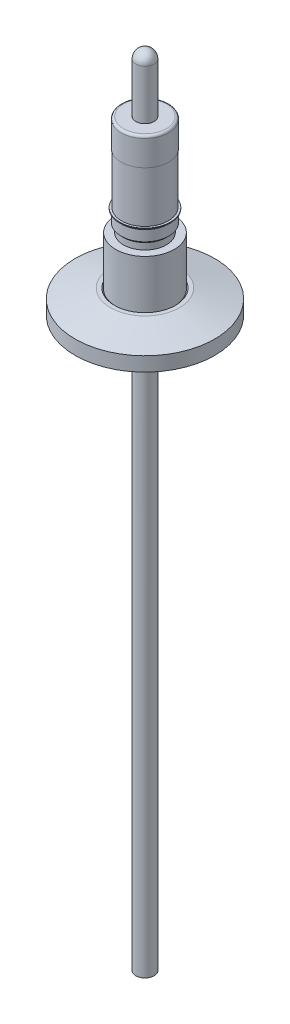
ISO-10303-21;
HEADER;
FILE_DESCRIPTION(('STEP AP214'),'2;1');
FILE_NAME('part.step','',(''),(''),'','','');
FILE_SCHEMA(('AUTOMOTIVE_DESIGN { 1 0 10303 214 1 1 1 1 }'));
ENDSEC;
DATA;
#1=APPLICATION_CONTEXT('core data for automotive mechanical design processes');
#2=APPLICATION_PROTOCOL_DEFINITION('international standard','automotive_design',2000,#1);
#3=PRODUCT_CONTEXT('',#1,'mechanical');
#4=PRODUCT('Part','Part','',(#3));
#5=PRODUCT_RELATED_PRODUCT_CATEGORY('part','',(#4));
#6=PRODUCT_DEFINITION_FORMATION('','',#4);
#7=PRODUCT_DEFINITION_CONTEXT('part definition',#1,'design');
#8=PRODUCT_DEFINITION('design','',#6,#7);
#9=PRODUCT_DEFINITION_SHAPE('','',#8);
#10=(LENGTH_UNIT() NAMED_UNIT(*) SI_UNIT(.MILLI.,.METRE.));
#11=(NAMED_UNIT(*) PLANE_ANGLE_UNIT() SI_UNIT($,.RADIAN.));
#12=(NAMED_UNIT(*) SI_UNIT($,.STERADIAN.) SOLID_ANGLE_UNIT());
#13=UNCERTAINTY_MEASURE_WITH_UNIT(LENGTH_MEASURE(1.E-05),#10,'distance_accuracy_value','');
#14=(GEOMETRIC_REPRESENTATION_CONTEXT(3) GLOBAL_UNCERTAINTY_ASSIGNED_CONTEXT((#13)) GLOBAL_UNIT_ASSIGNED_CONTEXT((#10,
#11,#12)) REPRESENTATION_CONTEXT('',''));
#15=CARTESIAN_POINT('',(0.,0.,0.));
#16=DIRECTION('',(0.,0.,1.));
#17=DIRECTION('',(1.,0.,0.));
#18=AXIS2_PLACEMENT_3D('',#15,#16,#17);
#19=CARTESIAN_POINT('',(5.5245,0.,0.));
#20=DIRECTION('',(0.,-1.,0.));
#21=DIRECTION('',(0.,0.,-1.));
#22=AXIS2_PLACEMENT_3D('',#19,#20,#21);
#23=PLANE('',#22);
#24=CARTESIAN_POINT('',(0.,0.,0.));
#25=DIRECTION('',(0.,1.,0.));
#26=DIRECTION('',(1.,0.,0.));
#27=AXIS2_PLACEMENT_3D('',#24,#25,#26);
#28=CIRCLE('',#27,8.6995);
#29=CARTESIAN_POINT('',(8.6995,0.,0.));
#30=VERTEX_POINT('',#29);
#31=EDGE_CURVE('E191',#30,#30,#28,.T.);
#32=ORIENTED_EDGE('',*,*,#31,.F.);
#33=EDGE_LOOP('',(#32));
#34=FACE_BOUND('',#33,.T.);
#35=CARTESIAN_POINT('',(0.,0.,0.));
#36=DIRECTION('',(0.,-1.,0.));
#37=DIRECTION('',(0.,0.,-1.));
#38=AXIS2_PLACEMENT_3D('',#35,#36,#37);
#39=CIRCLE('',#38,5.5245);
#40=CARTESIAN_POINT('',(0.,0.,-5.5245));
#41=VERTEX_POINT('',#40);
#42=EDGE_CURVE('E11',#41,#41,#39,.T.);
#43=ORIENTED_EDGE('',*,*,#42,.F.);
#44=EDGE_LOOP('',(#43));
#45=FACE_BOUND('',#44,.T.);
#46=ADVANCED_FACE('F19',(#34,#45),#23,.T.);
#47=CARTESIAN_POINT('',(0.,0.,0.));
#48=DIRECTION('',(0.,-1.,0.));
#49=DIRECTION('',(0.,0.,-1.));
#50=AXIS2_PLACEMENT_3D('',#47,#48,#49);
#51=CYLINDRICAL_SURFACE('',#50,5.5245);
#52=CARTESIAN_POINT('',(0.,6.35,0.));
#53=DIRECTION('',(0.,-1.,0.));
#54=DIRECTION('',(0.,0.,-1.));
#55=AXIS2_PLACEMENT_3D('',#52,#53,#54);
#56=CIRCLE('',#55,5.5245);
#57=CARTESIAN_POINT('',(0.,6.35,-5.5245));
#58=VERTEX_POINT('',#57);
#59=EDGE_CURVE('E30',#58,#58,#56,.T.);
#60=ORIENTED_EDGE('',*,*,#59,.F.);
#61=EDGE_LOOP('',(#60));
#62=FACE_BOUND('',#61,.T.);
#63=ORIENTED_EDGE('',*,*,#42,.T.);
#64=EDGE_LOOP('',(#63));
#65=FACE_BOUND('',#64,.T.);
#66=ADVANCED_FACE('F280',(#62,#65),#51,.F.);
#67=CARTESIAN_POINT('',(4.2672,6.35,0.));
#68=DIRECTION('',(0.,-1.,0.));
#69=DIRECTION('',(0.,0.,-1.));
#70=AXIS2_PLACEMENT_3D('',#67,#68,#69);
#71=PLANE('',#70);
#72=CARTESIAN_POINT('',(0.,6.35,0.));
#73=DIRECTION('',(0.,-1.,0.));
#74=DIRECTION('',(0.,0.,-1.));
#75=AXIS2_PLACEMENT_3D('',#72,#73,#74);
#76=CIRCLE('',#75,4.064);
#77=CARTESIAN_POINT('',(0.,6.35,-4.064));
#78=VERTEX_POINT('',#77);
#79=EDGE_CURVE('E192',#78,#78,#76,.T.);
#80=ORIENTED_EDGE('',*,*,#79,.F.);
#81=EDGE_LOOP('',(#80));
#82=FACE_BOUND('',#81,.T.);
#83=ORIENTED_EDGE('',*,*,#59,.T.);
#84=EDGE_LOOP('',(#83));
#85=FACE_BOUND('',#84,.T.);
#86=ADVANCED_FACE('F285',(#82,#85),#71,.T.);
#87=CARTESIAN_POINT('',(0.,3.05201287254541,0.));
#88=DIRECTION('',(0.,-1.,0.));
#89=DIRECTION('',(0.0635421050136828,0.,-0.997979158545122));
#90=AXIS2_PLACEMENT_3D('',#87,#88,#89);
#91=CYLINDRICAL_SURFACE('',#90,4.064);
#92=ORIENTED_EDGE('',*,*,#79,.T.);
#93=EDGE_LOOP('',(#92));
#94=FACE_BOUND('',#93,.T.);
#95=CARTESIAN_POINT('',(0.,5.4947420489686,0.));
#96=DIRECTION('',(0.,-1.,0.));
#97=DIRECTION('',(0.0635421050136828,0.,-0.997979158545122));
#98=AXIS2_PLACEMENT_3D('',#95,#96,#97);
#99=CIRCLE('',#98,4.064);
#100=CARTESIAN_POINT('',(0.258235114775605,5.4947420489686,-4.05578730032739));
#101=VERTEX_POINT('',#100);
#102=EDGE_CURVE('E196',#101,#101,#99,.T.);
#103=ORIENTED_EDGE('',*,*,#102,.F.);
#104=EDGE_LOOP('',(#103));
#105=FACE_BOUND('',#104,.T.);
#106=ADVANCED_FACE('F294',(#94,#105),#91,.T.);
#107=CARTESIAN_POINT('',(0.,5.24074204896862,0.));
#108=DIRECTION('',(0.,1.,0.));
#109=DIRECTION('',(-0.0635421050136827,0.,0.997979158545122));
#110=AXIS2_PLACEMENT_3D('',#107,#108,#109);
#111=CONICAL_SURFACE('',#110,3.81,0.785398163397442);
#112=CARTESIAN_POINT('',(0.,5.24074204896862,0.));
#113=DIRECTION('',(0.,-1.,0.));
#114=DIRECTION('',(0.0635421050136827,0.,-0.997979158545122));
#115=AXIS2_PLACEMENT_3D('',#112,#113,#114);
#116=CIRCLE('',#115,3.81);
#117=CARTESIAN_POINT('',(0.242095420102132,5.24074204896862,-3.80230059405693));
#118=VERTEX_POINT('',#117);
#119=EDGE_CURVE('E217',#118,#118,#116,.T.);
#120=ORIENTED_EDGE('',*,*,#119,.F.);
#121=EDGE_LOOP('',(#120));
#122=FACE_BOUND('',#121,.T.);
#123=ORIENTED_EDGE('',*,*,#102,.T.);
#124=EDGE_LOOP('',(#123));
#125=FACE_BOUND('',#124,.T.);
#126=ADVANCED_FACE('F290',(#122,#125),#111,.T.);
#127=CARTESIAN_POINT('',(1.92649896765551,5.24074204896862,0.122661679518413));
#128=DIRECTION('',(0.,-1.,0.));
#129=DIRECTION('',(0.,0.,-1.));
#130=AXIS2_PLACEMENT_3D('',#127,#128,#129);
#131=PLANE('',#130);
#132=ORIENTED_EDGE('',*,*,#119,.T.);
#133=EDGE_LOOP('',(#132));
#134=FACE_BOUND('',#133,.T.);
#135=CARTESIAN_POINT('',(0.,5.24074204896862,0.));
#136=DIRECTION('',(0.,1.,0.));
#137=DIRECTION('',(0.,0.,-1.));
#138=AXIS2_PLACEMENT_3D('',#135,#136,#137);
#139=CIRCLE('',#138,1.9558);
#140=CARTESIAN_POINT('',(0.,5.24074204896862,-1.9558));
#141=VERTEX_POINT('',#140);
#142=EDGE_CURVE('E210',#141,#141,#139,.T.);
#143=ORIENTED_EDGE('',*,*,#142,.T.);
#144=EDGE_LOOP('',(#143));
#145=FACE_BOUND('',#144,.T.);
#146=ADVANCED_FACE('F293',(#134,#145),#131,.T.);
#147=CARTESIAN_POINT('',(0.,46.9373820489687,0.));
#148=DIRECTION('',(0.,-1.,0.));
#149=DIRECTION('',(0.,0.,-1.));
#150=AXIS2_PLACEMENT_3D('',#147,#148,#149);
#151=CYLINDRICAL_SURFACE('',#150,1.9558);
#152=ORIENTED_EDGE('',*,*,#142,.F.);
#153=EDGE_LOOP('',(#152));
#154=FACE_BOUND('',#153,.T.);
#155=CARTESIAN_POINT('',(0.,-124.512617951032,0.));
#156=DIRECTION('',(0.,1.,0.));
#157=DIRECTION('',(0.,0.,1.));
#158=AXIS2_PLACEMENT_3D('',#155,#156,#157);
#159=CIRCLE('',#158,1.9558);
#160=CARTESIAN_POINT('',(0.,-124.512617951032,1.9558));
#161=VERTEX_POINT('',#160);
#162=EDGE_CURVE('E23',#161,#161,#159,.T.);
#163=ORIENTED_EDGE('',*,*,#162,.T.);
#164=EDGE_LOOP('',(#163));
#165=FACE_BOUND('',#164,.T.);
#166=ADVANCED_FACE('F322',(#154,#165),#151,.T.);
#167=CARTESIAN_POINT('',(0.,-124.512617951032,0.));
#168=DIRECTION('',(0.,1.,0.));
#169=DIRECTION('',(1.,0.,0.));
#170=AXIS2_PLACEMENT_3D('',#167,#168,#169);
#171=PLANE('',#170);
#172=ORIENTED_EDGE('',*,*,#162,.F.);
#173=EDGE_LOOP('',(#172));
#174=FACE_BOUND('',#173,.T.);
#175=ADVANCED_FACE('F324',(#174),#171,.F.);
#176=CARTESIAN_POINT('',(0.,0.,0.));
#177=DIRECTION('',(0.,-1.,0.));
#178=DIRECTION('',(1.,0.,0.));
#179=AXIS2_PLACEMENT_3D('',#176,#177,#178);
#180=CYLINDRICAL_SURFACE('',#179,8.6995);
#181=CARTESIAN_POINT('',(0.,-2.667,0.));
#182=DIRECTION('',(0.,1.,0.));
#183=DIRECTION('',(1.,0.,0.));
#184=AXIS2_PLACEMENT_3D('',#181,#182,#183);
#185=CIRCLE('',#184,8.6995);
#186=CARTESIAN_POINT('',(8.6995,-2.667,0.));
#187=VERTEX_POINT('',#186);
#188=EDGE_CURVE('E203',#187,#187,#185,.T.);
#189=ORIENTED_EDGE('',*,*,#188,.F.);
#190=EDGE_LOOP('',(#189));
#191=FACE_BOUND('',#190,.T.);
#192=ORIENTED_EDGE('',*,*,#31,.T.);
#193=EDGE_LOOP('',(#192));
#194=FACE_BOUND('',#193,.T.);
#195=ADVANCED_FACE('F330',(#191,#194),#180,.F.);
#196=CARTESIAN_POINT('',(0.,2.159,0.));
#197=DIRECTION('',(0.,1.,0.));
#198=DIRECTION('',(-1.,0.,0.));
#199=AXIS2_PLACEMENT_3D('',#196,#197,#198);
#200=CONICAL_SURFACE('',#199,6.2865,0.78539816339745);
#201=CARTESIAN_POINT('',(0.,2.413,0.));
#202=DIRECTION('',(0.,-1.,0.));
#203=DIRECTION('',(-1.,0.,0.));
#204=AXIS2_PLACEMENT_3D('',#201,#202,#203);
#205=CIRCLE('',#204,6.5405);
#206=CARTESIAN_POINT('',(-6.5405,2.413,0.));
#207=VERTEX_POINT('',#206);
#208=EDGE_CURVE('E127',#207,#207,#205,.T.);
#209=ORIENTED_EDGE('',*,*,#208,.F.);
#210=EDGE_LOOP('',(#209));
#211=FACE_BOUND('',#210,.T.);
#212=CARTESIAN_POINT('',(0.,2.159,0.));
#213=DIRECTION('',(0.,-1.,0.));
#214=DIRECTION('',(0.,0.,1.));
#215=AXIS2_PLACEMENT_3D('',#212,#213,#214);
#216=CIRCLE('',#215,6.2865);
#217=CARTESIAN_POINT('',(0.,2.159,6.2865));
#218=VERTEX_POINT('',#217);
#219=EDGE_CURVE('E170',#218,#218,#216,.T.);
#220=ORIENTED_EDGE('',*,*,#219,.T.);
#221=EDGE_LOOP('',(#220));
#222=FACE_BOUND('',#221,.T.);
#223=ADVANCED_FACE('F299',(#211,#222),#200,.F.);
#224=CARTESIAN_POINT('',(0.,3.78395474387525,0.));
#225=DIRECTION('',(0.,-1.,0.));
#226=DIRECTION('',(1.,0.,0.));
#227=AXIS2_PLACEMENT_3D('',#224,#225,#226);
#228=CONICAL_SURFACE('',#227,2.286,1.30899693899575);
#229=CARTESIAN_POINT('',(0.,2.413,0.));
#230=DIRECTION('',(0.,1.,0.));
#231=DIRECTION('',(-1.,0.,0.));
#232=AXIS2_PLACEMENT_3D('',#229,#230,#231);
#233=CIRCLE('',#232,7.40247275902005);
#234=CARTESIAN_POINT('',(-7.40247275902005,2.413,0.));
#235=VERTEX_POINT('',#234);
#236=EDGE_CURVE('E117',#235,#235,#233,.T.);
#237=ORIENTED_EDGE('',*,*,#236,.F.);
#238=EDGE_LOOP('',(#237));
#239=FACE_BOUND('',#238,.T.);
#240=CARTESIAN_POINT('',(0.,0.381,0.));
#241=DIRECTION('',(0.,1.,0.));
#242=DIRECTION('',(-1.,0.,0.));
#243=AXIS2_PLACEMENT_3D('',#240,#241,#242);
#244=CIRCLE('',#243,14.986);
#245=CARTESIAN_POINT('',(-14.986,0.381,0.));
#246=VERTEX_POINT('',#245);
#247=EDGE_CURVE('E188',#246,#246,#244,.T.);
#248=ORIENTED_EDGE('',*,*,#247,.T.);
#249=EDGE_LOOP('',(#248));
#250=FACE_BOUND('',#249,.T.);
#251=ADVANCED_FACE('F296',(#239,#250),#228,.T.);
#252=CARTESIAN_POINT('',(0.,-2.667,0.));
#253=DIRECTION('',(0.,1.,0.));
#254=DIRECTION('',(-1.,0.,0.));
#255=AXIS2_PLACEMENT_3D('',#252,#253,#254);
#256=CYLINDRICAL_SURFACE('',#255,14.986);
#257=ORIENTED_EDGE('',*,*,#247,.F.);
#258=EDGE_LOOP('',(#257));
#259=FACE_BOUND('',#258,.T.);
#260=CARTESIAN_POINT('',(0.,-2.667,0.));
#261=DIRECTION('',(0.,1.,0.));
#262=DIRECTION('',(1.,0.,0.));
#263=AXIS2_PLACEMENT_3D('',#260,#261,#262);
#264=CIRCLE('',#263,14.986);
#265=CARTESIAN_POINT('',(14.986,-2.667,0.));
#266=VERTEX_POINT('',#265);
#267=EDGE_CURVE('E183',#266,#266,#264,.T.);
#268=ORIENTED_EDGE('',*,*,#267,.T.);
#269=EDGE_LOOP('',(#268));
#270=FACE_BOUND('',#269,.T.);
#271=ADVANCED_FACE('F298',(#259,#270),#256,.T.);
#272=CARTESIAN_POINT('',(0.,2.413,0.));
#273=DIRECTION('',(0.,1.,0.));
#274=DIRECTION('',(0.,0.,-1.));
#275=AXIS2_PLACEMENT_3D('',#272,#273,#274);
#276=PLANE('',#275);
#277=ORIENTED_EDGE('',*,*,#236,.T.);
#278=EDGE_LOOP('',(#277));
#279=FACE_BOUND('',#278,.T.);
#280=ORIENTED_EDGE('',*,*,#208,.T.);
#281=EDGE_LOOP('',(#280));
#282=FACE_BOUND('',#281,.T.);
#283=ADVANCED_FACE('F274',(#279,#282),#276,.T.);
#284=CARTESIAN_POINT('',(0.,-2.667,0.));
#285=DIRECTION('',(0.,1.,0.));
#286=DIRECTION('',(0.,0.,-1.));
#287=AXIS2_PLACEMENT_3D('',#284,#285,#286);
#288=PLANE('',#287);
#289=ORIENTED_EDGE('',*,*,#188,.T.);
#290=EDGE_LOOP('',(#289));
#291=FACE_BOUND('',#290,.T.);
#292=ORIENTED_EDGE('',*,*,#267,.F.);
#293=EDGE_LOOP('',(#292));
#294=FACE_BOUND('',#293,.T.);
#295=ADVANCED_FACE('F264',(#291,#294),#288,.F.);
#296=CARTESIAN_POINT('',(0.,46.9373820489687,0.));
#297=DIRECTION('',(0.,-1.,0.));
#298=DIRECTION('',(0.,0.,-1.));
#299=AXIS2_PLACEMENT_3D('',#296,#297,#298);
#300=CYLINDRICAL_SURFACE('',#299,1.9558);
#301=CARTESIAN_POINT('',(0.,44.9841220489684,0.));
#302=DIRECTION('',(0.,-1.,0.));
#303=DIRECTION('',(0.,0.,1.));
#304=AXIS2_PLACEMENT_3D('',#301,#302,#303);
#305=CIRCLE('',#304,1.9558);
#306=CARTESIAN_POINT('',(0.,44.9841220489684,1.9558));
#307=VERTEX_POINT('',#306);
#308=EDGE_CURVE('E247',#307,#307,#305,.T.);
#309=ORIENTED_EDGE('',*,*,#308,.T.);
#310=EDGE_LOOP('',(#309));
#311=FACE_BOUND('',#310,.T.);
#312=CARTESIAN_POINT('',(0.,34.306684097937,0.));
#313=DIRECTION('',(0.,-1.,0.));
#314=DIRECTION('',(0.,0.,1.));
#315=AXIS2_PLACEMENT_3D('',#312,#313,#314);
#316=CIRCLE('',#315,1.9558);
#317=CARTESIAN_POINT('',(0.,34.306684097937,1.9558));
#318=VERTEX_POINT('',#317);
#319=EDGE_CURVE('E186',#318,#318,#316,.T.);
#320=ORIENTED_EDGE('',*,*,#319,.F.);
#321=EDGE_LOOP('',(#320));
#322=FACE_BOUND('',#321,.T.);
#323=ADVANCED_FACE('F261',(#311,#322),#300,.T.);
#324=CARTESIAN_POINT('',(0.,44.9841220489684,0.));
#325=DIRECTION('',(0.,1.,0.));
#326=DIRECTION('',(0.,0.,1.));
#327=AXIS2_PLACEMENT_3D('',#324,#325,#326);
#328=DEGENERATE_TOROIDAL_SURFACE('',#327,0.00253999999999923,1.95326,.T.);
#329=ORIENTED_EDGE('',*,*,#308,.F.);
#330=EDGE_LOOP('',(#329));
#331=FACE_BOUND('',#330,.T.);
#332=CARTESIAN_POINT('',(0.,46.9373820489687,0.));
#333=DIRECTION('',(0.,1.,0.));
#334=DIRECTION('',(0.,0.,1.));
#335=AXIS2_PLACEMENT_3D('',#332,#333,#334);
#336=CIRCLE('',#335,0.00253999999999923);
#337=CARTESIAN_POINT('',(0.,46.9373820489687,0.00253999999999923));
#338=VERTEX_POINT('',#337);
#339=EDGE_CURVE('E199',#338,#338,#336,.T.);
#340=ORIENTED_EDGE('',*,*,#339,.F.);
#341=EDGE_LOOP('',(#340));
#342=FACE_BOUND('',#341,.T.);
#343=ADVANCED_FACE('F263',(#331,#342),#328,.T.);
#344=CARTESIAN_POINT('',(0.,3.05201287254541,0.));
#345=DIRECTION('',(0.,-1.,0.));
#346=DIRECTION('',(0.0635421050136827,0.,-0.997979158545122));
#347=AXIS2_PLACEMENT_3D('',#344,#345,#346);
#348=CYLINDRICAL_SURFACE('',#347,5.1054);
#349=CARTESIAN_POINT('',(0.,33.798684097937,0.));
#350=DIRECTION('',(0.,-1.,0.));
#351=DIRECTION('',(0.0635421050136827,0.,-0.997979158545122));
#352=AXIS2_PLACEMENT_3D('',#349,#350,#351);
#353=CIRCLE('',#352,5.1054);
#354=CARTESIAN_POINT('',(0.324407862936855,33.798684097937,-5.09508279603628));
#355=VERTEX_POINT('',#354);
#356=EDGE_CURVE('E164',#355,#355,#353,.T.);
#357=ORIENTED_EDGE('',*,*,#356,.T.);
#358=EDGE_LOOP('',(#357));
#359=FACE_BOUND('',#358,.T.);
#360=CARTESIAN_POINT('',(0.,28.337684097937,0.));
#361=DIRECTION('',(0.,-1.,0.));
#362=DIRECTION('',(0.0635421050136827,0.,-0.997979158545122));
#363=AXIS2_PLACEMENT_3D('',#360,#361,#362);
#364=CIRCLE('',#363,5.1054);
#365=CARTESIAN_POINT('',(0.324407862936855,28.337684097937,-5.09508279603628));
#366=VERTEX_POINT('',#365);
#367=EDGE_CURVE('E237',#366,#366,#364,.T.);
#368=ORIENTED_EDGE('',*,*,#367,.F.);
#369=EDGE_LOOP('',(#368));
#370=FACE_BOUND('',#369,.T.);
#371=ADVANCED_FACE('F165',(#359,#370),#348,.T.);
#372=CARTESIAN_POINT('',(0.,3.05201287254541,0.));
#373=DIRECTION('',(0.,-1.,0.));
#374=DIRECTION('',(0.0635421050136827,0.,-0.997979158545122));
#375=AXIS2_PLACEMENT_3D('',#372,#373,#374);
#376=CYLINDRICAL_SURFACE('',#375,5.0165);
#377=CARTESIAN_POINT('',(0.,28.337684097937,0.));
#378=DIRECTION('',(0.,-1.,0.));
#379=DIRECTION('',(0.0635421050136827,0.,-0.997979158545122));
#380=AXIS2_PLACEMENT_3D('',#377,#378,#379);
#381=CIRCLE('',#380,5.0165);
#382=CARTESIAN_POINT('',(0.318758969801139,28.337684097937,-5.00636244884161));
#383=VERTEX_POINT('',#382);
#384=EDGE_CURVE('E202',#383,#383,#381,.T.);
#385=ORIENTED_EDGE('',*,*,#384,.T.);
#386=EDGE_LOOP('',(#385));
#387=FACE_BOUND('',#386,.T.);
#388=CARTESIAN_POINT('',(0.,17.3676174387893,0.));
#389=DIRECTION('',(0.,-1.,0.));
#390=DIRECTION('',(0.0635421050136827,0.,-0.997979158545122));
#391=AXIS2_PLACEMENT_3D('',#388,#389,#390);
#392=CIRCLE('',#391,5.0165);
#393=CARTESIAN_POINT('',(0.318758969801139,17.3676174387893,-5.00636244884161));
#394=VERTEX_POINT('',#393);
#395=EDGE_CURVE('E100',#394,#394,#392,.T.);
#396=ORIENTED_EDGE('',*,*,#395,.F.);
#397=EDGE_LOOP('',(#396));
#398=FACE_BOUND('',#397,.T.);
#399=ADVANCED_FACE('F362',(#387,#398),#376,.T.);
#400=CARTESIAN_POINT('',(0.,3.05201287254541,0.));
#401=DIRECTION('',(0.,-1.,0.));
#402=DIRECTION('',(0.0635421050136827,0.,-0.997979158545122));
#403=AXIS2_PLACEMENT_3D('',#400,#401,#402);
#404=CYLINDRICAL_SURFACE('',#403,5.4492025612107);
#405=CARTESIAN_POINT('',(0.,17.3676174387893,0.));
#406=DIRECTION('',(0.,-1.,0.));
#407=DIRECTION('',(0.0635421050136827,0.,-0.997979158545122));
#408=AXIS2_PLACEMENT_3D('',#405,#406,#407);
#409=CIRCLE('',#408,5.4492025612107);
#410=CARTESIAN_POINT('',(0.346253801385279,17.3676174387893,-5.43819058677896));
#411=VERTEX_POINT('',#410);
#412=EDGE_CURVE('E109',#411,#411,#409,.T.);
#413=ORIENTED_EDGE('',*,*,#412,.T.);
#414=EDGE_LOOP('',(#413));
#415=FACE_BOUND('',#414,.T.);
#416=CARTESIAN_POINT('',(0.,17.188012316368,0.));
#417=DIRECTION('',(0.,-1.,0.));
#418=DIRECTION('',(0.0635421050136827,0.,-0.997979158545122));
#419=AXIS2_PLACEMENT_3D('',#416,#417,#418);
#420=CIRCLE('',#419,5.4492025612107);
#421=CARTESIAN_POINT('',(0.346253801385279,17.188012316368,-5.43819058677896));
#422=VERTEX_POINT('',#421);
#423=EDGE_CURVE('E243',#422,#422,#420,.T.);
#424=ORIENTED_EDGE('',*,*,#423,.F.);
#425=EDGE_LOOP('',(#424));
#426=FACE_BOUND('',#425,.T.);
#427=ADVANCED_FACE('F21',(#415,#426),#404,.T.);
#428=CARTESIAN_POINT('',(0.,16.8442097551572,0.));
#429=DIRECTION('',(0.,1.,0.));
#430=DIRECTION('',(-0.0635421050136827,0.,0.997979158545122));
#431=AXIS2_PLACEMENT_3D('',#428,#429,#430);
#432=CONICAL_SURFACE('',#431,5.1054,0.78539816339745);
#433=CARTESIAN_POINT('',(0.,16.8442097551572,0.));
#434=DIRECTION('',(0.,-1.,0.));
#435=DIRECTION('',(0.0635421050136827,0.,-0.997979158545122));
#436=AXIS2_PLACEMENT_3D('',#433,#434,#435);
#437=CIRCLE('',#436,5.1054);
#438=CARTESIAN_POINT('',(0.324407862936855,16.8442097551572,-5.09508279603628));
#439=VERTEX_POINT('',#438);
#440=EDGE_CURVE('E248',#439,#439,#437,.T.);
#441=ORIENTED_EDGE('',*,*,#440,.F.);
#442=EDGE_LOOP('',(#441));
#443=FACE_BOUND('',#442,.T.);
#444=ORIENTED_EDGE('',*,*,#423,.T.);
#445=EDGE_LOOP('',(#444));
#446=FACE_BOUND('',#445,.T.);
#447=ADVANCED_FACE('F302',(#443,#446),#432,.T.);
#448=CARTESIAN_POINT('',(0.,3.05201287254541,0.));
#449=DIRECTION('',(0.,-1.,0.));
#450=DIRECTION('',(0.0635421050136827,0.,-0.997979158545122));
#451=AXIS2_PLACEMENT_3D('',#448,#449,#450);
#452=CYLINDRICAL_SURFACE('',#451,5.1054);
#453=ORIENTED_EDGE('',*,*,#440,.T.);
#454=EDGE_LOOP('',(#453));
#455=FACE_BOUND('',#454,.T.);
#456=CARTESIAN_POINT('',(0.,14.5741846327359,0.));
#457=DIRECTION('',(0.,-1.,0.));
#458=DIRECTION('',(0.0635421050136827,0.,-0.997979158545122));
#459=AXIS2_PLACEMENT_3D('',#456,#457,#458);
#460=CIRCLE('',#459,5.1054);
#461=CARTESIAN_POINT('',(0.324407862936855,14.5741846327359,-5.09508279603628));
#462=VERTEX_POINT('',#461);
#463=EDGE_CURVE('E176',#462,#462,#460,.T.);
#464=ORIENTED_EDGE('',*,*,#463,.F.);
#465=EDGE_LOOP('',(#464));
#466=FACE_BOUND('',#465,.T.);
#467=ADVANCED_FACE('F304',(#455,#466),#452,.T.);
#468=CARTESIAN_POINT('',(0.,14.0788846327359,0.));
#469=DIRECTION('',(0.,1.,0.));
#470=DIRECTION('',(-0.0635421050136827,0.,0.997979158545122));
#471=AXIS2_PLACEMENT_3D('',#468,#469,#470);
#472=CONICAL_SURFACE('',#471,4.6101,0.785398163397451);
#473=CARTESIAN_POINT('',(0.,14.0788846327359,0.));
#474=DIRECTION('',(0.,-1.,0.));
#475=DIRECTION('',(0.0635421050136827,0.,-0.997979158545122));
#476=AXIS2_PLACEMENT_3D('',#473,#474,#475);
#477=CIRCLE('',#476,4.6101);
#478=CARTESIAN_POINT('',(0.292935458323578,14.0788846327359,-4.60078371880888));
#479=VERTEX_POINT('',#478);
#480=EDGE_CURVE('E169',#479,#479,#477,.T.);
#481=ORIENTED_EDGE('',*,*,#480,.F.);
#482=EDGE_LOOP('',(#481));
#483=FACE_BOUND('',#482,.T.);
#484=ORIENTED_EDGE('',*,*,#463,.T.);
#485=EDGE_LOOP('',(#484));
#486=FACE_BOUND('',#485,.T.);
#487=ADVANCED_FACE('F309',(#483,#486),#472,.T.);
#488=CARTESIAN_POINT('',(0.,3.05201287254541,0.));
#489=DIRECTION('',(0.,-1.,0.));
#490=DIRECTION('',(0.0635421050136827,0.,-0.997979158545122));
#491=AXIS2_PLACEMENT_3D('',#488,#489,#490);
#492=CYLINDRICAL_SURFACE('',#491,4.6101);
#493=ORIENTED_EDGE('',*,*,#480,.T.);
#494=EDGE_LOOP('',(#493));
#495=FACE_BOUND('',#494,.T.);
#496=CARTESIAN_POINT('',(0.,12.7,0.));
#497=DIRECTION('',(0.,1.,0.));
#498=DIRECTION('',(0.,0.,1.));
#499=AXIS2_PLACEMENT_3D('',#496,#497,#498);
#500=CIRCLE('',#499,4.6101);
#501=CARTESIAN_POINT('',(0.,12.7,4.6101));
#502=VERTEX_POINT('',#501);
#503=EDGE_CURVE('E184',#502,#502,#500,.T.);
#504=ORIENTED_EDGE('',*,*,#503,.T.);
#505=EDGE_LOOP('',(#504));
#506=FACE_BOUND('',#505,.T.);
#507=ADVANCED_FACE('F312',(#495,#506),#492,.T.);
#508=CARTESIAN_POINT('',(0.,33.798684097937,0.));
#509=DIRECTION('',(0.,-1.,0.));
#510=DIRECTION('',(0.0635421050136827,0.,-0.997979158545122));
#511=AXIS2_PLACEMENT_3D('',#508,#509,#510);
#512=TOROIDAL_SURFACE('',#511,4.5974,0.508);
#513=CARTESIAN_POINT('',(0.,34.306684097937,0.));
#514=DIRECTION('',(0.,-1.,0.));
#515=DIRECTION('',(0.0635421050136827,0.,-0.997979158545122));
#516=AXIS2_PLACEMENT_3D('',#513,#514,#515);
#517=CIRCLE('',#516,4.5974);
#518=CARTESIAN_POINT('',(0.292128473589906,34.306684097937,-4.58810938349534));
#519=VERTEX_POINT('',#518);
#520=EDGE_CURVE('E179',#519,#519,#517,.T.);
#521=ORIENTED_EDGE('',*,*,#520,.T.);
#522=EDGE_LOOP('',(#521));
#523=FACE_BOUND('',#522,.T.);
#524=ORIENTED_EDGE('',*,*,#356,.F.);
#525=EDGE_LOOP('',(#524));
#526=FACE_BOUND('',#525,.T.);
#527=ADVANCED_FACE('F319',(#523,#526),#512,.T.);
#528=CARTESIAN_POINT('',(0.,0.,0.));
#529=DIRECTION('',(0.,-1.,0.));
#530=DIRECTION('',(0.,0.,-1.));
#531=AXIS2_PLACEMENT_3D('',#528,#529,#530);
#532=CYLINDRICAL_SURFACE('',#531,6.2865);
#533=CARTESIAN_POINT('',(0.,12.7,0.));
#534=DIRECTION('',(0.,-1.,0.));
#535=DIRECTION('',(0.,0.,-1.));
#536=AXIS2_PLACEMENT_3D('',#533,#534,#535);
#537=CIRCLE('',#536,6.2865);
#538=CARTESIAN_POINT('',(0.,12.7,-6.2865));
#539=VERTEX_POINT('',#538);
#540=EDGE_CURVE('E187',#539,#539,#537,.T.);
#541=ORIENTED_EDGE('',*,*,#540,.T.);
#542=EDGE_LOOP('',(#541));
#543=FACE_BOUND('',#542,.T.);
#544=ORIENTED_EDGE('',*,*,#219,.F.);
#545=EDGE_LOOP('',(#544));
#546=FACE_BOUND('',#545,.T.);
#547=ADVANCED_FACE('F317',(#543,#546),#532,.T.);
#548=CARTESIAN_POINT('',(4.58810938349534,34.306684097937,0.292128473589906));
#549=DIRECTION('',(0.,1.,0.));
#550=DIRECTION('',(1.,0.,0.));
#551=AXIS2_PLACEMENT_3D('',#548,#549,#550);
#552=PLANE('',#551);
#553=ORIENTED_EDGE('',*,*,#520,.F.);
#554=EDGE_LOOP('',(#553));
#555=FACE_BOUND('',#554,.T.);
#556=ORIENTED_EDGE('',*,*,#319,.T.);
#557=EDGE_LOOP('',(#556));
#558=FACE_BOUND('',#557,.T.);
#559=ADVANCED_FACE('F259',(#555,#558),#552,.T.);
#560=CARTESIAN_POINT('',(6.2865,12.7,0.));
#561=DIRECTION('',(0.,1.,0.));
#562=DIRECTION('',(1.,0.,0.));
#563=AXIS2_PLACEMENT_3D('',#560,#561,#562);
#564=PLANE('',#563);
#565=ORIENTED_EDGE('',*,*,#503,.F.);
#566=EDGE_LOOP('',(#565));
#567=FACE_BOUND('',#566,.T.);
#568=ORIENTED_EDGE('',*,*,#540,.F.);
#569=EDGE_LOOP('',(#568));
#570=FACE_BOUND('',#569,.T.);
#571=ADVANCED_FACE('F316',(#567,#570),#564,.T.);
#572=CARTESIAN_POINT('',(5.00636244884161,17.3676174387893,0.318758969801139));
#573=DIRECTION('',(0.,1.,0.));
#574=DIRECTION('',(1.,0.,0.));
#575=AXIS2_PLACEMENT_3D('',#572,#573,#574);
#576=PLANE('',#575);
#577=ORIENTED_EDGE('',*,*,#395,.T.);
#578=EDGE_LOOP('',(#577));
#579=FACE_BOUND('',#578,.T.);
#580=ORIENTED_EDGE('',*,*,#412,.F.);
#581=EDGE_LOOP('',(#580));
#582=FACE_BOUND('',#581,.T.);
#583=ADVANCED_FACE('F350',(#579,#582),#576,.T.);
#584=CARTESIAN_POINT('',(5.00636244884161,28.337684097937,0.318758969801139));
#585=DIRECTION('',(0.,-1.,0.));
#586=DIRECTION('',(0.,0.,-1.));
#587=AXIS2_PLACEMENT_3D('',#584,#585,#586);
#588=PLANE('',#587);
#589=ORIENTED_EDGE('',*,*,#367,.T.);
#590=EDGE_LOOP('',(#589));
#591=FACE_BOUND('',#590,.T.);
#592=ORIENTED_EDGE('',*,*,#384,.F.);
#593=EDGE_LOOP('',(#592));
#594=FACE_BOUND('',#593,.T.);
#595=ADVANCED_FACE('F346',(#591,#594),#588,.T.);
#596=CARTESIAN_POINT('',(0.,46.9373820489687,0.));
#597=DIRECTION('',(0.,1.,0.));
#598=DIRECTION('',(1.,0.,0.));
#599=AXIS2_PLACEMENT_3D('',#596,#597,#598);
#600=PLANE('',#599);
#601=ORIENTED_EDGE('',*,*,#339,.T.);
#602=EDGE_LOOP('',(#601));
#603=FACE_BOUND('',#602,.T.);
#604=ADVANCED_FACE('F349',(#603),#600,.T.);
#605=CLOSED_SHELL('',(#46,#66,#86,#106,#126,#146,#166,#175,#195,#223,#251,#271,#283,#295,#323,
#343,#371,#399,#427,#447,#467,#487,#507,#527,#547,#559,#571,#583,#595,#604));
#606=MANIFOLD_SOLID_BREP('B1',#605);
#607=ADVANCED_BREP_SHAPE_REPRESENTATION('',(#18,#606),#14);
#608=SHAPE_DEFINITION_REPRESENTATION(#9,#607);
ENDSEC;
END-ISO-10303-21;
